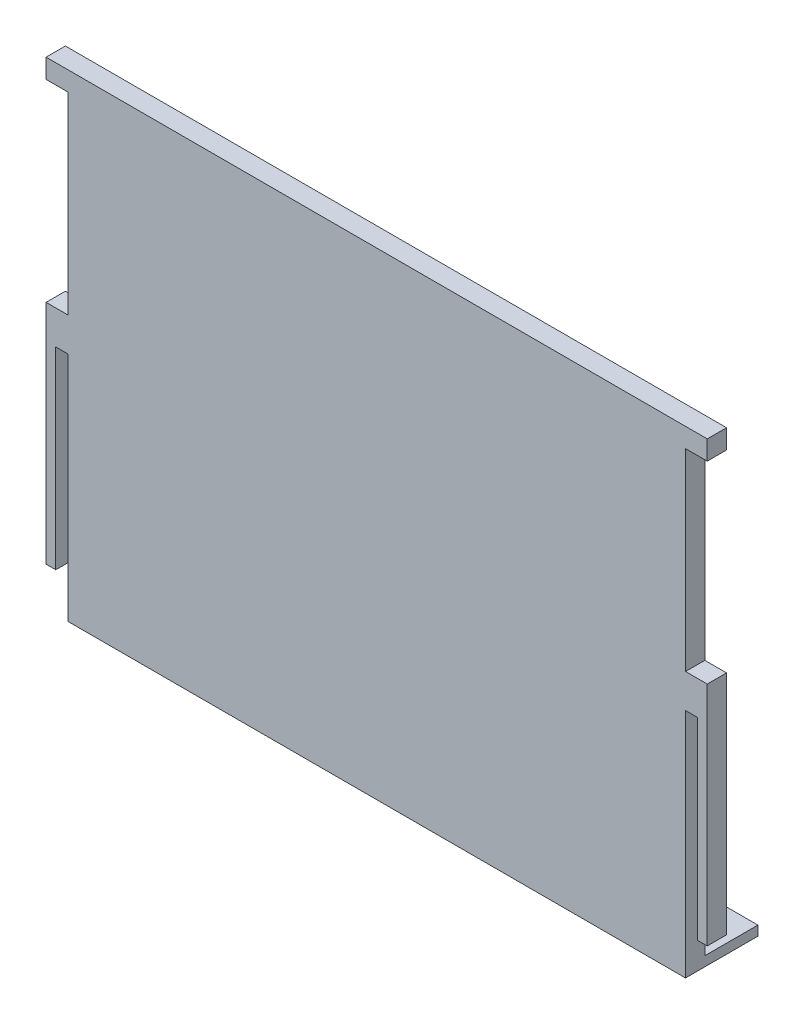
ISO-10303-21;
HEADER;
FILE_DESCRIPTION(('STEP AP214'),'2;1');
FILE_NAME('part.step','',(''),(''),'','','');
FILE_SCHEMA(('AUTOMOTIVE_DESIGN { 1 0 10303 214 1 1 1 1 }'));
ENDSEC;
DATA;
#1=APPLICATION_CONTEXT('core data for automotive mechanical design processes');
#2=APPLICATION_PROTOCOL_DEFINITION('international standard','automotive_design',2000,#1);
#3=PRODUCT_CONTEXT('',#1,'mechanical');
#4=PRODUCT('Part','Part','',(#3));
#5=PRODUCT_RELATED_PRODUCT_CATEGORY('part','',(#4));
#6=PRODUCT_DEFINITION_FORMATION('','',#4);
#7=PRODUCT_DEFINITION_CONTEXT('part definition',#1,'design');
#8=PRODUCT_DEFINITION('design','',#6,#7);
#9=PRODUCT_DEFINITION_SHAPE('','',#8);
#10=(LENGTH_UNIT() NAMED_UNIT(*) SI_UNIT(.MILLI.,.METRE.));
#11=(NAMED_UNIT(*) PLANE_ANGLE_UNIT() SI_UNIT($,.RADIAN.));
#12=(NAMED_UNIT(*) SI_UNIT($,.STERADIAN.) SOLID_ANGLE_UNIT());
#13=UNCERTAINTY_MEASURE_WITH_UNIT(LENGTH_MEASURE(1.E-05),#10,'distance_accuracy_value','');
#14=(GEOMETRIC_REPRESENTATION_CONTEXT(3) GLOBAL_UNCERTAINTY_ASSIGNED_CONTEXT((#13)) GLOBAL_UNIT_ASSIGNED_CONTEXT((#10,
#11,#12)) REPRESENTATION_CONTEXT('',''));
#15=CARTESIAN_POINT('',(0.,0.,0.));
#16=DIRECTION('',(0.,0.,1.));
#17=DIRECTION('',(1.,0.,0.));
#18=AXIS2_PLACEMENT_3D('',#15,#16,#17);
#19=CARTESIAN_POINT('',(68.5,-48.,4.));
#20=DIRECTION('',(-1.,0.,0.));
#21=DIRECTION('',(0.,0.,1.));
#22=AXIS2_PLACEMENT_3D('',#19,#20,#21);
#23=PLANE('',#22);
#24=DIRECTION('',(0.,0.,1.));
#25=VECTOR('',#24,1.);
#26=CARTESIAN_POINT('',(68.5,47.,0.));
#27=LINE('',#26,#25);
#28=CARTESIAN_POINT('',(68.5,47.,0.));
#29=VERTEX_POINT('',#28);
#30=CARTESIAN_POINT('',(68.5,47.,4.));
#31=VERTEX_POINT('',#30);
#32=EDGE_CURVE('E470',#29,#31,#27,.T.);
#33=ORIENTED_EDGE('',*,*,#32,.F.);
#34=DIRECTION('',(0.,1.,0.));
#35=VECTOR('',#34,1.);
#36=CARTESIAN_POINT('',(68.5,-48.,0.));
#37=LINE('',#36,#35);
#38=CARTESIAN_POINT('',(68.5,51.,0.));
#39=VERTEX_POINT('',#38);
#40=EDGE_CURVE('E596',#29,#39,#37,.T.);
#41=ORIENTED_EDGE('',*,*,#40,.T.);
#42=DIRECTION('',(0.,0.,-1.));
#43=VECTOR('',#42,1.);
#44=CARTESIAN_POINT('',(68.5,51.,4.));
#45=LINE('',#44,#43);
#46=CARTESIAN_POINT('',(68.5,51.,4.));
#47=VERTEX_POINT('',#46);
#48=EDGE_CURVE('E445',#47,#39,#45,.T.);
#49=ORIENTED_EDGE('',*,*,#48,.F.);
#50=DIRECTION('',(0.,1.,0.));
#51=VECTOR('',#50,1.);
#52=CARTESIAN_POINT('',(68.5,-48.,4.));
#53=LINE('',#52,#51);
#54=EDGE_CURVE('E607',#31,#47,#53,.T.);
#55=ORIENTED_EDGE('',*,*,#54,.F.);
#56=EDGE_LOOP('',(#33,#41,#49,#55));
#57=FACE_BOUND('',#56,.T.);
#58=ADVANCED_FACE('F39',(#57),#23,.F.);
#59=CARTESIAN_POINT('',(-68.5,-48.,4.));
#60=DIRECTION('',(1.,0.,0.));
#61=DIRECTION('',(0.,0.,-1.));
#62=AXIS2_PLACEMENT_3D('',#59,#60,#61);
#63=PLANE('',#62);
#64=DIRECTION('',(0.,0.,1.));
#65=VECTOR('',#64,1.);
#66=CARTESIAN_POINT('',(-68.5,47.,0.));
#67=LINE('',#66,#65);
#68=CARTESIAN_POINT('',(-68.5,47.,0.));
#69=VERTEX_POINT('',#68);
#70=CARTESIAN_POINT('',(-68.5,47.,4.));
#71=VERTEX_POINT('',#70);
#72=EDGE_CURVE('E544',#69,#71,#67,.T.);
#73=ORIENTED_EDGE('',*,*,#72,.T.);
#74=DIRECTION('',(0.,-1.,0.));
#75=VECTOR('',#74,1.);
#76=CARTESIAN_POINT('',(-68.5,-48.,4.));
#77=LINE('',#76,#75);
#78=CARTESIAN_POINT('',(-68.5,51.,4.00000000000002));
#79=VERTEX_POINT('',#78);
#80=EDGE_CURVE('E608',#79,#71,#77,.T.);
#81=ORIENTED_EDGE('',*,*,#80,.F.);
#82=DIRECTION('',(0.,0.,1.));
#83=VECTOR('',#82,1.);
#84=CARTESIAN_POINT('',(-68.5,51.,4.00000000000002));
#85=LINE('',#84,#83);
#86=CARTESIAN_POINT('',(-68.5,51.,0.));
#87=VERTEX_POINT('',#86);
#88=EDGE_CURVE('E456',#87,#79,#85,.T.);
#89=ORIENTED_EDGE('',*,*,#88,.F.);
#90=DIRECTION('',(0.,-1.,0.));
#91=VECTOR('',#90,1.);
#92=CARTESIAN_POINT('',(-68.5,-48.,0.));
#93=LINE('',#92,#91);
#94=EDGE_CURVE('E618',#87,#69,#93,.T.);
#95=ORIENTED_EDGE('',*,*,#94,.T.);
#96=EDGE_LOOP('',(#73,#81,#89,#95));
#97=FACE_BOUND('',#96,.T.);
#98=ADVANCED_FACE('F659',(#97),#63,.F.);
#99=CARTESIAN_POINT('',(0.,0.,4.));
#100=DIRECTION('',(0.,0.,-1.));
#101=DIRECTION('',(-1.,0.,0.));
#102=AXIS2_PLACEMENT_3D('',#99,#100,#101);
#103=PLANE('',#102);
#104=DIRECTION('',(0.,1.,0.));
#105=VECTOR('',#104,1.);
#106=CARTESIAN_POINT('',(-64.,0.,4.));
#107=LINE('',#106,#105);
#108=CARTESIAN_POINT('',(-64.,-48.,4.));
#109=VERTEX_POINT('',#108);
#110=CARTESIAN_POINT('',(-64.,0.,4.));
#111=VERTEX_POINT('',#110);
#112=EDGE_CURVE('E575',#109,#111,#107,.T.);
#113=ORIENTED_EDGE('',*,*,#112,.F.);
#114=DIRECTION('',(1.,0.,0.));
#115=VECTOR('',#114,1.);
#116=CARTESIAN_POINT('',(-68.5,-48.,4.));
#117=LINE('',#116,#115);
#118=CARTESIAN_POINT('',(64.,-48.,4.));
#119=VERTEX_POINT('',#118);
#120=EDGE_CURVE('E48',#109,#119,#117,.T.);
#121=ORIENTED_EDGE('',*,*,#120,.T.);
#122=DIRECTION('',(0.,-1.,0.));
#123=VECTOR('',#122,1.);
#124=CARTESIAN_POINT('',(64.,0.,4.));
#125=LINE('',#124,#123);
#126=CARTESIAN_POINT('',(64.,0.,4.));
#127=VERTEX_POINT('',#126);
#128=EDGE_CURVE('E514',#127,#119,#125,.T.);
#129=ORIENTED_EDGE('',*,*,#128,.F.);
#130=DIRECTION('',(1.,0.,0.));
#131=VECTOR('',#130,1.);
#132=CARTESIAN_POINT('',(0.,0.,4.));
#133=LINE('',#132,#131);
#134=CARTESIAN_POINT('',(66.5,0.,4.));
#135=VERTEX_POINT('',#134);
#136=EDGE_CURVE('E517',#127,#135,#133,.T.);
#137=ORIENTED_EDGE('',*,*,#136,.T.);
#138=DIRECTION('',(0.,-1.,0.));
#139=VECTOR('',#138,1.);
#140=CARTESIAN_POINT('',(66.5,0.,4.));
#141=LINE('',#140,#139);
#142=CARTESIAN_POINT('',(66.5,-40.,4.));
#143=VERTEX_POINT('',#142);
#144=EDGE_CURVE('E522',#135,#143,#141,.T.);
#145=ORIENTED_EDGE('',*,*,#144,.T.);
#146=DIRECTION('',(-1.,0.,0.));
#147=VECTOR('',#146,1.);
#148=CARTESIAN_POINT('',(64.,-40.,4.));
#149=LINE('',#148,#147);
#150=CARTESIAN_POINT('',(68.5,-40.,4.));
#151=VERTEX_POINT('',#150);
#152=EDGE_CURVE('E388',#151,#143,#149,.T.);
#153=ORIENTED_EDGE('',*,*,#152,.F.);
#154=CARTESIAN_POINT('',(68.5,6.99999999999999,4.));
#155=VERTEX_POINT('',#154);
#156=EDGE_CURVE('E603',#151,#155,#53,.T.);
#157=ORIENTED_EDGE('',*,*,#156,.T.);
#158=DIRECTION('',(1.,0.,0.));
#159=VECTOR('',#158,1.);
#160=CARTESIAN_POINT('',(64.,6.99999999999999,4.));
#161=LINE('',#160,#159);
#162=CARTESIAN_POINT('',(64.,6.99999999999999,4.));
#163=VERTEX_POINT('',#162);
#164=EDGE_CURVE('E487',#163,#155,#161,.T.);
#165=ORIENTED_EDGE('',*,*,#164,.F.);
#166=DIRECTION('',(0.,1.,0.));
#167=VECTOR('',#166,1.);
#168=CARTESIAN_POINT('',(64.,6.99999999999999,4.));
#169=LINE('',#168,#167);
#170=CARTESIAN_POINT('',(64.,47.,4.));
#171=VERTEX_POINT('',#170);
#172=EDGE_CURVE('E478',#163,#171,#169,.T.);
#173=ORIENTED_EDGE('',*,*,#172,.T.);
#174=DIRECTION('',(1.,0.,0.));
#175=VECTOR('',#174,1.);
#176=CARTESIAN_POINT('',(64.,47.,4.));
#177=LINE('',#176,#175);
#178=EDGE_CURVE('E482',#171,#31,#177,.T.);
#179=ORIENTED_EDGE('',*,*,#178,.T.);
#180=ORIENTED_EDGE('',*,*,#54,.T.);
#181=DIRECTION('',(1.,0.,0.));
#182=VECTOR('',#181,1.);
#183=CARTESIAN_POINT('',(68.5,51.,4.));
#184=LINE('',#183,#182);
#185=EDGE_CURVE('E460',#79,#47,#184,.T.);
#186=ORIENTED_EDGE('',*,*,#185,.F.);
#187=ORIENTED_EDGE('',*,*,#80,.T.);
#188=DIRECTION('',(1.,0.,0.));
#189=VECTOR('',#188,1.);
#190=CARTESIAN_POINT('',(-68.5,47.,4.));
#191=LINE('',#190,#189);
#192=CARTESIAN_POINT('',(-64.,47.,4.));
#193=VERTEX_POINT('',#192);
#194=EDGE_CURVE('E513',#71,#193,#191,.T.);
#195=ORIENTED_EDGE('',*,*,#194,.T.);
#196=DIRECTION('',(0.,-1.,0.));
#197=VECTOR('',#196,1.);
#198=CARTESIAN_POINT('',(-64.,47.,4.));
#199=LINE('',#198,#197);
#200=CARTESIAN_POINT('',(-64.,6.99999999999999,4.));
#201=VERTEX_POINT('',#200);
#202=EDGE_CURVE('E553',#193,#201,#199,.T.);
#203=ORIENTED_EDGE('',*,*,#202,.T.);
#204=DIRECTION('',(1.,0.,0.));
#205=VECTOR('',#204,1.);
#206=CARTESIAN_POINT('',(-68.5,6.99999999999999,4.));
#207=LINE('',#206,#205);
#208=CARTESIAN_POINT('',(-68.5,6.99999999999999,4.));
#209=VERTEX_POINT('',#208);
#210=EDGE_CURVE('E549',#209,#201,#207,.T.);
#211=ORIENTED_EDGE('',*,*,#210,.F.);
#212=CARTESIAN_POINT('',(-68.5,-40.,4.));
#213=VERTEX_POINT('',#212);
#214=EDGE_CURVE('E606',#209,#213,#77,.T.);
#215=ORIENTED_EDGE('',*,*,#214,.T.);
#216=DIRECTION('',(-1.,0.,0.));
#217=VECTOR('',#216,1.);
#218=CARTESIAN_POINT('',(-64.,-40.,4.));
#219=LINE('',#218,#217);
#220=CARTESIAN_POINT('',(-66.5,-40.,4.));
#221=VERTEX_POINT('',#220);
#222=EDGE_CURVE('E403',#221,#213,#219,.T.);
#223=ORIENTED_EDGE('',*,*,#222,.F.);
#224=DIRECTION('',(0.,-1.,0.));
#225=VECTOR('',#224,1.);
#226=CARTESIAN_POINT('',(-66.5,0.,4.));
#227=LINE('',#226,#225);
#228=CARTESIAN_POINT('',(-66.5,-3.74917113892465E-13,4.));
#229=VERTEX_POINT('',#228);
#230=EDGE_CURVE('E586',#229,#221,#227,.T.);
#231=ORIENTED_EDGE('',*,*,#230,.F.);
#232=DIRECTION('',(-1.,0.,0.));
#233=VECTOR('',#232,1.);
#234=CARTESIAN_POINT('',(0.,0.,4.));
#235=LINE('',#234,#233);
#236=EDGE_CURVE('E526',#111,#229,#235,.T.);
#237=ORIENTED_EDGE('',*,*,#236,.F.);
#238=EDGE_LOOP('',(#113,#121,#129,#137,#145,#153,#157,#165,#173,#179,#180,#186,#187,#195,#203,
#211,#215,#223,#231,#237));
#239=FACE_BOUND('',#238,.T.);
#240=ADVANCED_FACE('F647',(#239),#103,.F.);
#241=CARTESIAN_POINT('',(0.,0.,0.));
#242=DIRECTION('',(0.,0.,-1.));
#243=DIRECTION('',(-1.,0.,0.));
#244=AXIS2_PLACEMENT_3D('',#241,#242,#243);
#245=PLANE('',#244);
#246=DIRECTION('',(0.,1.,0.));
#247=VECTOR('',#246,1.);
#248=CARTESIAN_POINT('',(-34.6,-9.29999999999999,0.));
#249=LINE('',#248,#247);
#250=CARTESIAN_POINT('',(-34.6,-9.29999999999999,0.));
#251=VERTEX_POINT('',#250);
#252=CARTESIAN_POINT('',(-34.6,44.9,0.));
#253=VERTEX_POINT('',#252);
#254=EDGE_CURVE('E55',#251,#253,#249,.T.);
#255=ORIENTED_EDGE('',*,*,#254,.F.);
#256=DIRECTION('',(-1.,0.,0.));
#257=VECTOR('',#256,1.);
#258=CARTESIAN_POINT('',(-34.6,-9.29999999999999,0.));
#259=LINE('',#258,#257);
#260=CARTESIAN_POINT('',(34.6,-9.3,0.));
#261=VERTEX_POINT('',#260);
#262=EDGE_CURVE('E318',#261,#251,#259,.T.);
#263=ORIENTED_EDGE('',*,*,#262,.F.);
#264=DIRECTION('',(0.,-1.,0.));
#265=VECTOR('',#264,1.);
#266=CARTESIAN_POINT('',(34.6,-9.3,0.));
#267=LINE('',#266,#265);
#268=CARTESIAN_POINT('',(34.6,44.9,0.));
#269=VERTEX_POINT('',#268);
#270=EDGE_CURVE('E337',#269,#261,#267,.T.);
#271=ORIENTED_EDGE('',*,*,#270,.F.);
#272=DIRECTION('',(1.,0.,0.));
#273=VECTOR('',#272,1.);
#274=CARTESIAN_POINT('',(-34.6,44.9,0.));
#275=LINE('',#274,#273);
#276=EDGE_CURVE('E333',#253,#269,#275,.T.);
#277=ORIENTED_EDGE('',*,*,#276,.F.);
#278=EDGE_LOOP('',(#255,#263,#271,#277));
#279=FACE_BOUND('',#278,.T.);
#280=DIRECTION('',(0.,1.,0.));
#281=VECTOR('',#280,1.);
#282=CARTESIAN_POINT('',(20.8,-44.3,0.));
#283=LINE('',#282,#281);
#284=CARTESIAN_POINT('',(20.8,-44.3,0.));
#285=VERTEX_POINT('',#284);
#286=CARTESIAN_POINT('',(20.8,-16.1,0.));
#287=VERTEX_POINT('',#286);
#288=EDGE_CURVE('E63',#285,#287,#283,.T.);
#289=ORIENTED_EDGE('',*,*,#288,.F.);
#290=DIRECTION('',(-1.,0.,0.));
#291=VECTOR('',#290,1.);
#292=CARTESIAN_POINT('',(20.8,-44.3,0.));
#293=LINE('',#292,#291);
#294=CARTESIAN_POINT('',(60.,-44.3,0.));
#295=VERTEX_POINT('',#294);
#296=EDGE_CURVE('E284',#295,#285,#293,.T.);
#297=ORIENTED_EDGE('',*,*,#296,.F.);
#298=DIRECTION('',(0.,-1.,0.));
#299=VECTOR('',#298,1.);
#300=CARTESIAN_POINT('',(60.,-44.3,0.));
#301=LINE('',#300,#299);
#302=CARTESIAN_POINT('',(60.,-16.1,0.));
#303=VERTEX_POINT('',#302);
#304=EDGE_CURVE('E288',#303,#295,#301,.T.);
#305=ORIENTED_EDGE('',*,*,#304,.F.);
#306=DIRECTION('',(1.,0.,0.));
#307=VECTOR('',#306,1.);
#308=CARTESIAN_POINT('',(20.8,-16.1,0.));
#309=LINE('',#308,#307);
#310=EDGE_CURVE('E297',#287,#303,#309,.T.);
#311=ORIENTED_EDGE('',*,*,#310,.F.);
#312=EDGE_LOOP('',(#289,#297,#305,#311));
#313=FACE_BOUND('',#312,.T.);
#314=DIRECTION('',(0.,1.,0.));
#315=VECTOR('',#314,1.);
#316=CARTESIAN_POINT('',(-60.,-44.3,0.));
#317=LINE('',#316,#315);
#318=CARTESIAN_POINT('',(-60.,-44.3,0.));
#319=VERTEX_POINT('',#318);
#320=CARTESIAN_POINT('',(-60.,-16.1,0.));
#321=VERTEX_POINT('',#320);
#322=EDGE_CURVE('E307',#319,#321,#317,.T.);
#323=ORIENTED_EDGE('',*,*,#322,.F.);
#324=DIRECTION('',(-1.,0.,0.));
#325=VECTOR('',#324,1.);
#326=CARTESIAN_POINT('',(-60.,-44.3,0.));
#327=LINE('',#326,#325);
#328=CARTESIAN_POINT('',(-20.8,-44.3,0.));
#329=VERTEX_POINT('',#328);
#330=EDGE_CURVE('E359',#329,#319,#327,.T.);
#331=ORIENTED_EDGE('',*,*,#330,.F.);
#332=DIRECTION('',(0.,-1.,0.));
#333=VECTOR('',#332,1.);
#334=CARTESIAN_POINT('',(-20.8,-44.3,0.));
#335=LINE('',#334,#333);
#336=CARTESIAN_POINT('',(-20.8,-16.1,0.));
#337=VERTEX_POINT('',#336);
#338=EDGE_CURVE('E378',#337,#329,#335,.T.);
#339=ORIENTED_EDGE('',*,*,#338,.F.);
#340=DIRECTION('',(1.,0.,0.));
#341=VECTOR('',#340,1.);
#342=CARTESIAN_POINT('',(-60.,-16.1,0.));
#343=LINE('',#342,#341);
#344=EDGE_CURVE('E374',#321,#337,#343,.T.);
#345=ORIENTED_EDGE('',*,*,#344,.F.);
#346=EDGE_LOOP('',(#323,#331,#339,#345));
#347=FACE_BOUND('',#346,.T.);
#348=DIRECTION('',(1.,0.,0.));
#349=VECTOR('',#348,1.);
#350=CARTESIAN_POINT('',(68.5,-46.,0.));
#351=LINE('',#350,#349);
#352=CARTESIAN_POINT('',(-64.,-46.,0.));
#353=VERTEX_POINT('',#352);
#354=CARTESIAN_POINT('',(64.,-46.,0.));
#355=VERTEX_POINT('',#354);
#356=EDGE_CURVE('E436',#353,#355,#351,.T.);
#357=ORIENTED_EDGE('',*,*,#356,.F.);
#358=DIRECTION('',(0.,1.,0.));
#359=VECTOR('',#358,1.);
#360=CARTESIAN_POINT('',(-64.,0.,0.));
#361=LINE('',#360,#359);
#362=CARTESIAN_POINT('',(-64.,0.,0.));
#363=VERTEX_POINT('',#362);
#364=EDGE_CURVE('E579',#353,#363,#361,.T.);
#365=ORIENTED_EDGE('',*,*,#364,.T.);
#366=DIRECTION('',(-1.,0.,0.));
#367=VECTOR('',#366,1.);
#368=CARTESIAN_POINT('',(0.,0.,0.));
#369=LINE('',#368,#367);
#370=CARTESIAN_POINT('',(-66.5,-3.74917111245485E-13,0.));
#371=VERTEX_POINT('',#370);
#372=EDGE_CURVE('E570',#363,#371,#369,.T.);
#373=ORIENTED_EDGE('',*,*,#372,.T.);
#374=DIRECTION('',(0.,-1.,0.));
#375=VECTOR('',#374,1.);
#376=CARTESIAN_POINT('',(-66.5,0.,0.));
#377=LINE('',#376,#375);
#378=CARTESIAN_POINT('',(-66.5,-40.,0.));
#379=VERTEX_POINT('',#378);
#380=EDGE_CURVE('E574',#371,#379,#377,.T.);
#381=ORIENTED_EDGE('',*,*,#380,.T.);
#382=DIRECTION('',(1.,0.,0.));
#383=VECTOR('',#382,1.);
#384=CARTESIAN_POINT('',(0.,-40.,0.));
#385=LINE('',#384,#383);
#386=CARTESIAN_POINT('',(-68.5,-40.,0.));
#387=VERTEX_POINT('',#386);
#388=EDGE_CURVE('E433',#387,#379,#385,.T.);
#389=ORIENTED_EDGE('',*,*,#388,.F.);
#390=CARTESIAN_POINT('',(-68.5,6.99999999999999,0.));
#391=VERTEX_POINT('',#390);
#392=EDGE_CURVE('E617',#391,#387,#93,.T.);
#393=ORIENTED_EDGE('',*,*,#392,.F.);
#394=DIRECTION('',(1.,0.,0.));
#395=VECTOR('',#394,1.);
#396=CARTESIAN_POINT('',(-68.5,6.99999999999999,0.));
#397=LINE('',#396,#395);
#398=CARTESIAN_POINT('',(-64.,6.99999999999999,0.));
#399=VERTEX_POINT('',#398);
#400=EDGE_CURVE('E548',#391,#399,#397,.T.);
#401=ORIENTED_EDGE('',*,*,#400,.T.);
#402=DIRECTION('',(0.,-1.,0.));
#403=VECTOR('',#402,1.);
#404=CARTESIAN_POINT('',(-64.,47.,0.));
#405=LINE('',#404,#403);
#406=CARTESIAN_POINT('',(-64.,47.,0.));
#407=VERTEX_POINT('',#406);
#408=EDGE_CURVE('E564',#407,#399,#405,.T.);
#409=ORIENTED_EDGE('',*,*,#408,.F.);
#410=DIRECTION('',(1.,0.,0.));
#411=VECTOR('',#410,1.);
#412=CARTESIAN_POINT('',(-68.5,47.,0.));
#413=LINE('',#412,#411);
#414=EDGE_CURVE('E554',#69,#407,#413,.T.);
#415=ORIENTED_EDGE('',*,*,#414,.F.);
#416=ORIENTED_EDGE('',*,*,#94,.F.);
#417=DIRECTION('',(-1.,0.,0.));
#418=VECTOR('',#417,1.);
#419=CARTESIAN_POINT('',(68.5,51.,0.));
#420=LINE('',#419,#418);
#421=EDGE_CURVE('E452',#39,#87,#420,.T.);
#422=ORIENTED_EDGE('',*,*,#421,.F.);
#423=ORIENTED_EDGE('',*,*,#40,.F.);
#424=DIRECTION('',(1.,0.,0.));
#425=VECTOR('',#424,1.);
#426=CARTESIAN_POINT('',(64.,47.,0.));
#427=LINE('',#426,#425);
#428=CARTESIAN_POINT('',(64.,47.,0.));
#429=VERTEX_POINT('',#428);
#430=EDGE_CURVE('E495',#429,#29,#427,.T.);
#431=ORIENTED_EDGE('',*,*,#430,.F.);
#432=DIRECTION('',(0.,1.,0.));
#433=VECTOR('',#432,1.);
#434=CARTESIAN_POINT('',(64.,6.99999999999999,0.));
#435=LINE('',#434,#433);
#436=CARTESIAN_POINT('',(64.,6.99999999999999,0.));
#437=VERTEX_POINT('',#436);
#438=EDGE_CURVE('E469',#437,#429,#435,.T.);
#439=ORIENTED_EDGE('',*,*,#438,.F.);
#440=DIRECTION('',(1.,0.,0.));
#441=VECTOR('',#440,1.);
#442=CARTESIAN_POINT('',(64.,6.99999999999999,0.));
#443=LINE('',#442,#441);
#444=CARTESIAN_POINT('',(68.5,6.99999999999999,0.));
#445=VERTEX_POINT('',#444);
#446=EDGE_CURVE('E483',#437,#445,#443,.T.);
#447=ORIENTED_EDGE('',*,*,#446,.T.);
#448=CARTESIAN_POINT('',(68.5,-40.,0.));
#449=VERTEX_POINT('',#448);
#450=EDGE_CURVE('E615',#449,#445,#37,.T.);
#451=ORIENTED_EDGE('',*,*,#450,.F.);
#452=DIRECTION('',(1.,0.,0.));
#453=VECTOR('',#452,1.);
#454=CARTESIAN_POINT('',(0.,-40.,0.));
#455=LINE('',#454,#453);
#456=CARTESIAN_POINT('',(66.5,-40.,0.));
#457=VERTEX_POINT('',#456);
#458=EDGE_CURVE('E430',#457,#449,#455,.T.);
#459=ORIENTED_EDGE('',*,*,#458,.F.);
#460=DIRECTION('',(0.,-1.,0.));
#461=VECTOR('',#460,1.);
#462=CARTESIAN_POINT('',(66.5,0.,0.));
#463=LINE('',#462,#461);
#464=CARTESIAN_POINT('',(66.5,0.,0.));
#465=VERTEX_POINT('',#464);
#466=EDGE_CURVE('E518',#465,#457,#463,.T.);
#467=ORIENTED_EDGE('',*,*,#466,.F.);
#468=DIRECTION('',(1.,0.,0.));
#469=VECTOR('',#468,1.);
#470=CARTESIAN_POINT('',(0.,0.,0.));
#471=LINE('',#470,#469);
#472=CARTESIAN_POINT('',(64.,0.,0.));
#473=VERTEX_POINT('',#472);
#474=EDGE_CURVE('E529',#473,#465,#471,.T.);
#475=ORIENTED_EDGE('',*,*,#474,.F.);
#476=DIRECTION('',(0.,-1.,0.));
#477=VECTOR('',#476,1.);
#478=CARTESIAN_POINT('',(64.,0.,0.));
#479=LINE('',#478,#477);
#480=EDGE_CURVE('E505',#473,#355,#479,.T.);
#481=ORIENTED_EDGE('',*,*,#480,.T.);
#482=EDGE_LOOP('',(#357,#365,#373,#381,#389,#393,#401,#409,#415,#416,#422,#423,#431,#439,#447,
#451,#459,#467,#475,#481));
#483=FACE_BOUND('',#482,.T.);
#484=ADVANCED_FACE('F635',(#279,#313,#347,#483),#245,.T.);
#485=ORIENTED_EDGE('',*,*,#156,.F.);
#486=DIRECTION('',(0.,0.,1.));
#487=VECTOR('',#486,1.);
#488=CARTESIAN_POINT('',(68.5,-40.,-11.));
#489=LINE('',#488,#487);
#490=EDGE_CURVE('E406',#449,#151,#489,.T.);
#491=ORIENTED_EDGE('',*,*,#490,.F.);
#492=ORIENTED_EDGE('',*,*,#450,.T.);
#493=DIRECTION('',(0.,0.,1.));
#494=VECTOR('',#493,1.);
#495=CARTESIAN_POINT('',(68.5,6.99999999999999,0.));
#496=LINE('',#495,#494);
#497=EDGE_CURVE('E465',#445,#155,#496,.T.);
#498=ORIENTED_EDGE('',*,*,#497,.T.);
#499=EDGE_LOOP('',(#485,#491,#492,#498));
#500=FACE_BOUND('',#499,.T.);
#501=ADVANCED_FACE('F41',(#500),#23,.F.);
#502=ORIENTED_EDGE('',*,*,#392,.T.);
#503=DIRECTION('',(0.,0.,1.));
#504=VECTOR('',#503,1.);
#505=CARTESIAN_POINT('',(-68.5,-40.,-11.));
#506=LINE('',#505,#504);
#507=EDGE_CURVE('E402',#387,#213,#506,.T.);
#508=ORIENTED_EDGE('',*,*,#507,.T.);
#509=ORIENTED_EDGE('',*,*,#214,.F.);
#510=DIRECTION('',(0.,0.,1.));
#511=VECTOR('',#510,1.);
#512=CARTESIAN_POINT('',(-68.5,6.99999999999999,0.));
#513=LINE('',#512,#511);
#514=EDGE_CURVE('E541',#391,#209,#513,.T.);
#515=ORIENTED_EDGE('',*,*,#514,.F.);
#516=EDGE_LOOP('',(#502,#508,#509,#515));
#517=FACE_BOUND('',#516,.T.);
#518=ADVANCED_FACE('F629',(#517),#63,.F.);
#519=CARTESIAN_POINT('',(-68.5,-48.,4.));
#520=DIRECTION('',(0.,1.,0.));
#521=DIRECTION('',(0.,0.,1.));
#522=AXIS2_PLACEMENT_3D('',#519,#520,#521);
#523=PLANE('',#522);
#524=ORIENTED_EDGE('',*,*,#120,.F.);
#525=DIRECTION('',(0.,0.,1.));
#526=VECTOR('',#525,1.);
#527=CARTESIAN_POINT('',(-64.,-48.,-11.));
#528=LINE('',#527,#526);
#529=CARTESIAN_POINT('',(-64.,-48.,-11.));
#530=VERTEX_POINT('',#529);
#531=EDGE_CURVE('E407',#530,#109,#528,.T.);
#532=ORIENTED_EDGE('',*,*,#531,.F.);
#533=DIRECTION('',(-1.,0.,0.));
#534=VECTOR('',#533,1.);
#535=CARTESIAN_POINT('',(68.5,-48.,-11.));
#536=LINE('',#535,#534);
#537=CARTESIAN_POINT('',(64.,-48.,-11.));
#538=VERTEX_POINT('',#537);
#539=EDGE_CURVE('E437',#538,#530,#536,.T.);
#540=ORIENTED_EDGE('',*,*,#539,.F.);
#541=DIRECTION('',(0.,0.,1.));
#542=VECTOR('',#541,1.);
#543=CARTESIAN_POINT('',(64.,-48.,-11.));
#544=LINE('',#543,#542);
#545=EDGE_CURVE('E417',#538,#119,#544,.T.);
#546=ORIENTED_EDGE('',*,*,#545,.T.);
#547=EDGE_LOOP('',(#524,#532,#540,#546));
#548=FACE_BOUND('',#547,.T.);
#549=ADVANCED_FACE('F714',(#548),#523,.F.);
#550=CARTESIAN_POINT('',(0.,0.,0.));
#551=DIRECTION('',(0.,1.,0.));
#552=DIRECTION('',(-1.,0.,0.));
#553=AXIS2_PLACEMENT_3D('',#550,#551,#552);
#554=PLANE('',#553);
#555=ORIENTED_EDGE('',*,*,#236,.T.);
#556=DIRECTION('',(0.,0.,1.));
#557=VECTOR('',#556,1.);
#558=CARTESIAN_POINT('',(-66.5,-3.74917111245485E-13,0.));
#559=LINE('',#558,#557);
#560=EDGE_CURVE('E583',#371,#229,#559,.T.);
#561=ORIENTED_EDGE('',*,*,#560,.F.);
#562=ORIENTED_EDGE('',*,*,#372,.F.);
#563=DIRECTION('',(0.,0.,1.));
#564=VECTOR('',#563,1.);
#565=CARTESIAN_POINT('',(-64.,0.,0.));
#566=LINE('',#565,#564);
#567=EDGE_CURVE('E593',#363,#111,#566,.T.);
#568=ORIENTED_EDGE('',*,*,#567,.T.);
#569=EDGE_LOOP('',(#555,#561,#562,#568));
#570=FACE_BOUND('',#569,.T.);
#571=ADVANCED_FACE('F717',(#570),#554,.F.);
#572=CARTESIAN_POINT('',(-64.,0.,0.));
#573=DIRECTION('',(1.,0.,0.));
#574=DIRECTION('',(0.,1.,0.));
#575=AXIS2_PLACEMENT_3D('',#572,#573,#574);
#576=PLANE('',#575);
#577=ORIENTED_EDGE('',*,*,#112,.T.);
#578=ORIENTED_EDGE('',*,*,#567,.F.);
#579=ORIENTED_EDGE('',*,*,#364,.F.);
#580=DIRECTION('',(0.,0.,1.));
#581=VECTOR('',#580,1.);
#582=CARTESIAN_POINT('',(-64.,-46.,-11.));
#583=LINE('',#582,#581);
#584=CARTESIAN_POINT('',(-64.,-46.,-11.));
#585=VERTEX_POINT('',#584);
#586=EDGE_CURVE('E426',#585,#353,#583,.T.);
#587=ORIENTED_EDGE('',*,*,#586,.F.);
#588=DIRECTION('',(0.,1.,0.));
#589=VECTOR('',#588,1.);
#590=CARTESIAN_POINT('',(-64.,-40.,-11.));
#591=LINE('',#590,#589);
#592=EDGE_CURVE('E398',#530,#585,#591,.T.);
#593=ORIENTED_EDGE('',*,*,#592,.F.);
#594=ORIENTED_EDGE('',*,*,#531,.T.);
#595=EDGE_LOOP('',(#577,#578,#579,#587,#593,#594));
#596=FACE_BOUND('',#595,.T.);
#597=ADVANCED_FACE('F707',(#596),#576,.F.);
#598=CARTESIAN_POINT('',(-66.5,0.,0.));
#599=DIRECTION('',(-1.,0.,0.));
#600=DIRECTION('',(0.,-1.,0.));
#601=AXIS2_PLACEMENT_3D('',#598,#599,#600);
#602=PLANE('',#601);
#603=ORIENTED_EDGE('',*,*,#230,.T.);
#604=DIRECTION('',(0.,0.,1.));
#605=VECTOR('',#604,1.);
#606=CARTESIAN_POINT('',(-66.5,-40.,0.));
#607=LINE('',#606,#605);
#608=EDGE_CURVE('E597',#379,#221,#607,.T.);
#609=ORIENTED_EDGE('',*,*,#608,.F.);
#610=ORIENTED_EDGE('',*,*,#380,.F.);
#611=ORIENTED_EDGE('',*,*,#560,.T.);
#612=EDGE_LOOP('',(#603,#609,#610,#611));
#613=FACE_BOUND('',#612,.T.);
#614=ADVANCED_FACE('F643',(#613),#602,.F.);
#615=CARTESIAN_POINT('',(64.,6.99999999999999,0.));
#616=DIRECTION('',(0.,-1.,0.));
#617=DIRECTION('',(0.,0.,-1.));
#618=AXIS2_PLACEMENT_3D('',#615,#616,#617);
#619=PLANE('',#618);
#620=ORIENTED_EDGE('',*,*,#164,.T.);
#621=ORIENTED_EDGE('',*,*,#497,.F.);
#622=ORIENTED_EDGE('',*,*,#446,.F.);
#623=DIRECTION('',(0.,0.,1.));
#624=VECTOR('',#623,1.);
#625=CARTESIAN_POINT('',(64.,6.99999999999999,0.));
#626=LINE('',#625,#624);
#627=EDGE_CURVE('E464',#437,#163,#626,.T.);
#628=ORIENTED_EDGE('',*,*,#627,.T.);
#629=EDGE_LOOP('',(#620,#621,#622,#628));
#630=FACE_BOUND('',#629,.T.);
#631=ADVANCED_FACE('F681',(#630),#619,.F.);
#632=CARTESIAN_POINT('',(64.,6.99999999999999,0.));
#633=DIRECTION('',(1.,0.,0.));
#634=DIRECTION('',(0.,1.,0.));
#635=AXIS2_PLACEMENT_3D('',#632,#633,#634);
#636=PLANE('',#635);
#637=ORIENTED_EDGE('',*,*,#172,.F.);
#638=ORIENTED_EDGE('',*,*,#627,.F.);
#639=ORIENTED_EDGE('',*,*,#438,.T.);
#640=DIRECTION('',(0.,0.,1.));
#641=VECTOR('',#640,1.);
#642=CARTESIAN_POINT('',(64.,47.,0.));
#643=LINE('',#642,#641);
#644=EDGE_CURVE('E473',#429,#171,#643,.T.);
#645=ORIENTED_EDGE('',*,*,#644,.T.);
#646=EDGE_LOOP('',(#637,#638,#639,#645));
#647=FACE_BOUND('',#646,.T.);
#648=ADVANCED_FACE('F676',(#647),#636,.T.);
#649=CARTESIAN_POINT('',(64.,47.,0.));
#650=DIRECTION('',(0.,-1.,0.));
#651=DIRECTION('',(0.,0.,-1.));
#652=AXIS2_PLACEMENT_3D('',#649,#650,#651);
#653=PLANE('',#652);
#654=ORIENTED_EDGE('',*,*,#178,.F.);
#655=ORIENTED_EDGE('',*,*,#644,.F.);
#656=ORIENTED_EDGE('',*,*,#430,.T.);
#657=ORIENTED_EDGE('',*,*,#32,.T.);
#658=EDGE_LOOP('',(#654,#655,#656,#657));
#659=FACE_BOUND('',#658,.T.);
#660=ADVANCED_FACE('F673',(#659),#653,.T.);
#661=CARTESIAN_POINT('',(-68.5,47.,0.));
#662=DIRECTION('',(0.,-1.,0.));
#663=DIRECTION('',(0.,0.,-1.));
#664=AXIS2_PLACEMENT_3D('',#661,#662,#663);
#665=PLANE('',#664);
#666=ORIENTED_EDGE('',*,*,#194,.F.);
#667=ORIENTED_EDGE('',*,*,#72,.F.);
#668=ORIENTED_EDGE('',*,*,#414,.T.);
#669=DIRECTION('',(0.,0.,1.));
#670=VECTOR('',#669,1.);
#671=CARTESIAN_POINT('',(-64.,47.,0.));
#672=LINE('',#671,#670);
#673=EDGE_CURVE('E491',#407,#193,#672,.T.);
#674=ORIENTED_EDGE('',*,*,#673,.T.);
#675=EDGE_LOOP('',(#666,#667,#668,#674));
#676=FACE_BOUND('',#675,.T.);
#677=ADVANCED_FACE('F658',(#676),#665,.T.);
#678=CARTESIAN_POINT('',(-64.,47.,0.));
#679=DIRECTION('',(-1.,0.,0.));
#680=DIRECTION('',(0.,0.,1.));
#681=AXIS2_PLACEMENT_3D('',#678,#679,#680);
#682=PLANE('',#681);
#683=ORIENTED_EDGE('',*,*,#202,.F.);
#684=ORIENTED_EDGE('',*,*,#673,.F.);
#685=ORIENTED_EDGE('',*,*,#408,.T.);
#686=DIRECTION('',(0.,0.,1.));
#687=VECTOR('',#686,1.);
#688=CARTESIAN_POINT('',(-64.,6.99999999999999,0.));
#689=LINE('',#688,#687);
#690=EDGE_CURVE('E538',#399,#201,#689,.T.);
#691=ORIENTED_EDGE('',*,*,#690,.T.);
#692=EDGE_LOOP('',(#683,#684,#685,#691));
#693=FACE_BOUND('',#692,.T.);
#694=ADVANCED_FACE('F654',(#693),#682,.T.);
#695=CARTESIAN_POINT('',(-68.5,6.99999999999999,0.));
#696=DIRECTION('',(0.,-1.,0.));
#697=DIRECTION('',(0.,0.,-1.));
#698=AXIS2_PLACEMENT_3D('',#695,#696,#697);
#699=PLANE('',#698);
#700=ORIENTED_EDGE('',*,*,#210,.T.);
#701=ORIENTED_EDGE('',*,*,#690,.F.);
#702=ORIENTED_EDGE('',*,*,#400,.F.);
#703=ORIENTED_EDGE('',*,*,#514,.T.);
#704=EDGE_LOOP('',(#700,#701,#702,#703));
#705=FACE_BOUND('',#704,.T.);
#706=ADVANCED_FACE('F651',(#705),#699,.F.);
#707=CARTESIAN_POINT('',(66.5,0.,0.));
#708=DIRECTION('',(-1.,0.,0.));
#709=DIRECTION('',(0.,0.,1.));
#710=AXIS2_PLACEMENT_3D('',#707,#708,#709);
#711=PLANE('',#710);
#712=ORIENTED_EDGE('',*,*,#144,.F.);
#713=DIRECTION('',(0.,0.,1.));
#714=VECTOR('',#713,1.);
#715=CARTESIAN_POINT('',(66.5,0.,0.));
#716=LINE('',#715,#714);
#717=EDGE_CURVE('E501',#465,#135,#716,.T.);
#718=ORIENTED_EDGE('',*,*,#717,.F.);
#719=ORIENTED_EDGE('',*,*,#466,.T.);
#720=DIRECTION('',(0.,0.,1.));
#721=VECTOR('',#720,1.);
#722=CARTESIAN_POINT('',(66.5,-40.,0.));
#723=LINE('',#722,#721);
#724=EDGE_CURVE('E509',#457,#143,#723,.T.);
#725=ORIENTED_EDGE('',*,*,#724,.T.);
#726=EDGE_LOOP('',(#712,#718,#719,#725));
#727=FACE_BOUND('',#726,.T.);
#728=ADVANCED_FACE('F695',(#727),#711,.T.);
#729=CARTESIAN_POINT('',(64.,0.,0.));
#730=DIRECTION('',(-1.,0.,0.));
#731=DIRECTION('',(0.,0.,1.));
#732=AXIS2_PLACEMENT_3D('',#729,#730,#731);
#733=PLANE('',#732);
#734=ORIENTED_EDGE('',*,*,#128,.T.);
#735=ORIENTED_EDGE('',*,*,#545,.F.);
#736=DIRECTION('',(0.,-1.,0.));
#737=VECTOR('',#736,1.);
#738=CARTESIAN_POINT('',(64.,0.,-11.));
#739=LINE('',#738,#737);
#740=CARTESIAN_POINT('',(64.,-46.,-11.));
#741=VERTEX_POINT('',#740);
#742=EDGE_CURVE('E11',#741,#538,#739,.T.);
#743=ORIENTED_EDGE('',*,*,#742,.F.);
#744=DIRECTION('',(0.,0.,-1.));
#745=VECTOR('',#744,1.);
#746=CARTESIAN_POINT('',(64.,-46.,-11.));
#747=LINE('',#746,#745);
#748=EDGE_CURVE('E411',#355,#741,#747,.T.);
#749=ORIENTED_EDGE('',*,*,#748,.F.);
#750=ORIENTED_EDGE('',*,*,#480,.F.);
#751=DIRECTION('',(0.,0.,1.));
#752=VECTOR('',#751,1.);
#753=CARTESIAN_POINT('',(64.,0.,0.));
#754=LINE('',#753,#752);
#755=EDGE_CURVE('E506',#473,#127,#754,.T.);
#756=ORIENTED_EDGE('',*,*,#755,.T.);
#757=EDGE_LOOP('',(#734,#735,#743,#749,#750,#756));
#758=FACE_BOUND('',#757,.T.);
#759=ADVANCED_FACE('F702',(#758),#733,.F.);
#760=CARTESIAN_POINT('',(0.,0.,0.));
#761=DIRECTION('',(0.,-1.,0.));
#762=DIRECTION('',(0.,0.,-1.));
#763=AXIS2_PLACEMENT_3D('',#760,#761,#762);
#764=PLANE('',#763);
#765=ORIENTED_EDGE('',*,*,#136,.F.);
#766=ORIENTED_EDGE('',*,*,#755,.F.);
#767=ORIENTED_EDGE('',*,*,#474,.T.);
#768=ORIENTED_EDGE('',*,*,#717,.T.);
#769=EDGE_LOOP('',(#765,#766,#767,#768));
#770=FACE_BOUND('',#769,.T.);
#771=ADVANCED_FACE('F697',(#770),#764,.T.);
#772=CARTESIAN_POINT('',(0.,51.,0.));
#773=DIRECTION('',(0.,1.,0.));
#774=DIRECTION('',(0.,0.,1.));
#775=AXIS2_PLACEMENT_3D('',#772,#773,#774);
#776=PLANE('',#775);
#777=ORIENTED_EDGE('',*,*,#48,.T.);
#778=ORIENTED_EDGE('',*,*,#421,.T.);
#779=ORIENTED_EDGE('',*,*,#88,.T.);
#780=ORIENTED_EDGE('',*,*,#185,.T.);
#781=EDGE_LOOP('',(#777,#778,#779,#780));
#782=FACE_BOUND('',#781,.T.);
#783=ADVANCED_FACE('F664',(#782),#776,.T.);
#784=CARTESIAN_POINT('',(68.5,-46.,-11.));
#785=DIRECTION('',(0.,-1.,0.));
#786=DIRECTION('',(0.,0.,-1.));
#787=AXIS2_PLACEMENT_3D('',#784,#785,#786);
#788=PLANE('',#787);
#789=DIRECTION('',(1.,0.,0.));
#790=VECTOR('',#789,1.);
#791=CARTESIAN_POINT('',(68.5,-46.,-11.));
#792=LINE('',#791,#790);
#793=EDGE_CURVE('E441',#585,#741,#792,.T.);
#794=ORIENTED_EDGE('',*,*,#793,.F.);
#795=ORIENTED_EDGE('',*,*,#586,.T.);
#796=ORIENTED_EDGE('',*,*,#356,.T.);
#797=ORIENTED_EDGE('',*,*,#748,.T.);
#798=EDGE_LOOP('',(#794,#795,#796,#797));
#799=FACE_BOUND('',#798,.T.);
#800=ADVANCED_FACE('F705',(#799),#788,.F.);
#801=CARTESIAN_POINT('',(0.,0.,-11.));
#802=DIRECTION('',(0.,0.,1.));
#803=DIRECTION('',(1.,0.,0.));
#804=AXIS2_PLACEMENT_3D('',#801,#802,#803);
#805=PLANE('',#804);
#806=ORIENTED_EDGE('',*,*,#539,.T.);
#807=ORIENTED_EDGE('',*,*,#592,.T.);
#808=ORIENTED_EDGE('',*,*,#793,.T.);
#809=ORIENTED_EDGE('',*,*,#742,.T.);
#810=EDGE_LOOP('',(#806,#807,#808,#809));
#811=FACE_BOUND('',#810,.T.);
#812=ADVANCED_FACE('F710',(#811),#805,.F.);
#813=CARTESIAN_POINT('',(64.,-40.,-11.));
#814=DIRECTION('',(0.,1.,0.));
#815=DIRECTION('',(0.,0.,1.));
#816=AXIS2_PLACEMENT_3D('',#813,#814,#815);
#817=PLANE('',#816);
#818=ORIENTED_EDGE('',*,*,#458,.T.);
#819=ORIENTED_EDGE('',*,*,#490,.T.);
#820=ORIENTED_EDGE('',*,*,#152,.T.);
#821=ORIENTED_EDGE('',*,*,#724,.F.);
#822=EDGE_LOOP('',(#818,#819,#820,#821));
#823=FACE_BOUND('',#822,.T.);
#824=ADVANCED_FACE('F690',(#823),#817,.F.);
#825=CARTESIAN_POINT('',(-64.,-40.,-11.));
#826=DIRECTION('',(0.,1.,0.));
#827=DIRECTION('',(0.,0.,1.));
#828=AXIS2_PLACEMENT_3D('',#825,#826,#827);
#829=PLANE('',#828);
#830=ORIENTED_EDGE('',*,*,#388,.T.);
#831=ORIENTED_EDGE('',*,*,#608,.T.);
#832=ORIENTED_EDGE('',*,*,#222,.T.);
#833=ORIENTED_EDGE('',*,*,#507,.F.);
#834=EDGE_LOOP('',(#830,#831,#832,#833));
#835=FACE_BOUND('',#834,.T.);
#836=ADVANCED_FACE('F640',(#835),#829,.F.);
#837=CARTESIAN_POINT('',(-60.,-44.3,2.));
#838=DIRECTION('',(-1.,0.,0.));
#839=DIRECTION('',(0.,0.,1.));
#840=AXIS2_PLACEMENT_3D('',#837,#838,#839);
#841=PLANE('',#840);
#842=ORIENTED_EDGE('',*,*,#322,.T.);
#843=DIRECTION('',(0.,0.,-1.));
#844=VECTOR('',#843,1.);
#845=CARTESIAN_POINT('',(-60.,-16.1,2.));
#846=LINE('',#845,#844);
#847=CARTESIAN_POINT('',(-60.,-16.1,2.));
#848=VERTEX_POINT('',#847);
#849=EDGE_CURVE('E371',#848,#321,#846,.T.);
#850=ORIENTED_EDGE('',*,*,#849,.F.);
#851=DIRECTION('',(0.,1.,0.));
#852=VECTOR('',#851,1.);
#853=CARTESIAN_POINT('',(-60.,-44.3,2.));
#854=LINE('',#853,#852);
#855=CARTESIAN_POINT('',(-60.,-44.3,2.));
#856=VERTEX_POINT('',#855);
#857=EDGE_CURVE('E354',#856,#848,#854,.T.);
#858=ORIENTED_EDGE('',*,*,#857,.F.);
#859=DIRECTION('',(0.,0.,-1.));
#860=VECTOR('',#859,1.);
#861=CARTESIAN_POINT('',(-60.,-44.3,2.));
#862=LINE('',#861,#860);
#863=EDGE_CURVE('E385',#856,#319,#862,.T.);
#864=ORIENTED_EDGE('',*,*,#863,.T.);
#865=EDGE_LOOP('',(#842,#850,#858,#864));
#866=FACE_BOUND('',#865,.T.);
#867=ADVANCED_FACE('F752',(#866),#841,.F.);
#868=CARTESIAN_POINT('',(-60.,-44.3,2.));
#869=DIRECTION('',(0.,-1.,0.));
#870=DIRECTION('',(1.,0.,0.));
#871=AXIS2_PLACEMENT_3D('',#868,#869,#870);
#872=PLANE('',#871);
#873=ORIENTED_EDGE('',*,*,#330,.T.);
#874=ORIENTED_EDGE('',*,*,#863,.F.);
#875=DIRECTION('',(-1.,0.,0.));
#876=VECTOR('',#875,1.);
#877=CARTESIAN_POINT('',(-60.,-44.3,2.));
#878=LINE('',#877,#876);
#879=CARTESIAN_POINT('',(-20.8,-44.3,2.));
#880=VERTEX_POINT('',#879);
#881=EDGE_CURVE('E367',#880,#856,#878,.T.);
#882=ORIENTED_EDGE('',*,*,#881,.F.);
#883=DIRECTION('',(0.,0.,-1.));
#884=VECTOR('',#883,1.);
#885=CARTESIAN_POINT('',(-20.8,-44.3,2.));
#886=LINE('',#885,#884);
#887=EDGE_CURVE('E389',#880,#329,#886,.T.);
#888=ORIENTED_EDGE('',*,*,#887,.T.);
#889=EDGE_LOOP('',(#873,#874,#882,#888));
#890=FACE_BOUND('',#889,.T.);
#891=ADVANCED_FACE('F762',(#890),#872,.F.);
#892=CARTESIAN_POINT('',(-20.8,-44.3,2.));
#893=DIRECTION('',(1.,0.,0.));
#894=DIRECTION('',(0.,1.,0.));
#895=AXIS2_PLACEMENT_3D('',#892,#893,#894);
#896=PLANE('',#895);
#897=ORIENTED_EDGE('',*,*,#338,.T.);
#898=ORIENTED_EDGE('',*,*,#887,.F.);
#899=DIRECTION('',(0.,-1.,0.));
#900=VECTOR('',#899,1.);
#901=CARTESIAN_POINT('',(-20.8,-44.3,2.));
#902=LINE('',#901,#900);
#903=CARTESIAN_POINT('',(-20.8,-16.1,2.));
#904=VERTEX_POINT('',#903);
#905=EDGE_CURVE('E363',#904,#880,#902,.T.);
#906=ORIENTED_EDGE('',*,*,#905,.F.);
#907=DIRECTION('',(0.,0.,-1.));
#908=VECTOR('',#907,1.);
#909=CARTESIAN_POINT('',(-20.8,-16.1,2.));
#910=LINE('',#909,#908);
#911=EDGE_CURVE('E392',#904,#337,#910,.T.);
#912=ORIENTED_EDGE('',*,*,#911,.T.);
#913=EDGE_LOOP('',(#897,#898,#906,#912));
#914=FACE_BOUND('',#913,.T.);
#915=ADVANCED_FACE('F764',(#914),#896,.F.);
#916=CARTESIAN_POINT('',(-60.,-16.1,2.));
#917=DIRECTION('',(0.,1.,0.));
#918=DIRECTION('',(-1.,0.,0.));
#919=AXIS2_PLACEMENT_3D('',#916,#917,#918);
#920=PLANE('',#919);
#921=ORIENTED_EDGE('',*,*,#344,.T.);
#922=ORIENTED_EDGE('',*,*,#911,.F.);
#923=DIRECTION('',(1.,0.,0.));
#924=VECTOR('',#923,1.);
#925=CARTESIAN_POINT('',(-60.,-16.1,2.));
#926=LINE('',#925,#924);
#927=EDGE_CURVE('E358',#848,#904,#926,.T.);
#928=ORIENTED_EDGE('',*,*,#927,.F.);
#929=ORIENTED_EDGE('',*,*,#849,.T.);
#930=EDGE_LOOP('',(#921,#922,#928,#929));
#931=FACE_BOUND('',#930,.T.);
#932=ADVANCED_FACE('F756',(#931),#920,.F.);
#933=CARTESIAN_POINT('',(0.,0.,2.));
#934=DIRECTION('',(0.,0.,-1.));
#935=DIRECTION('',(-1.,0.,0.));
#936=AXIS2_PLACEMENT_3D('',#933,#934,#935);
#937=PLANE('',#936);
#938=ORIENTED_EDGE('',*,*,#857,.T.);
#939=ORIENTED_EDGE('',*,*,#927,.T.);
#940=ORIENTED_EDGE('',*,*,#905,.T.);
#941=ORIENTED_EDGE('',*,*,#881,.T.);
#942=EDGE_LOOP('',(#938,#939,#940,#941));
#943=FACE_BOUND('',#942,.T.);
#944=ADVANCED_FACE('F759',(#943),#937,.T.);
#945=CARTESIAN_POINT('',(20.8,-44.3,2.));
#946=DIRECTION('',(-1.,0.,0.));
#947=DIRECTION('',(0.,0.,1.));
#948=AXIS2_PLACEMENT_3D('',#945,#946,#947);
#949=PLANE('',#948);
#950=ORIENTED_EDGE('',*,*,#288,.T.);
#951=DIRECTION('',(0.,0.,-1.));
#952=VECTOR('',#951,1.);
#953=CARTESIAN_POINT('',(20.8,-16.1,2.));
#954=LINE('',#953,#952);
#955=CARTESIAN_POINT('',(20.8,-16.1,2.));
#956=VERTEX_POINT('',#955);
#957=EDGE_CURVE('E259',#956,#287,#954,.T.);
#958=ORIENTED_EDGE('',*,*,#957,.F.);
#959=DIRECTION('',(0.,1.,0.));
#960=VECTOR('',#959,1.);
#961=CARTESIAN_POINT('',(20.8,-44.3,2.));
#962=LINE('',#961,#960);
#963=CARTESIAN_POINT('',(20.8,-44.3,2.));
#964=VERTEX_POINT('',#963);
#965=EDGE_CURVE('E263',#964,#956,#962,.T.);
#966=ORIENTED_EDGE('',*,*,#965,.F.);
#967=DIRECTION('',(0.,0.,-1.));
#968=VECTOR('',#967,1.);
#969=CARTESIAN_POINT('',(20.8,-44.3,2.));
#970=LINE('',#969,#968);
#971=EDGE_CURVE('E304',#964,#285,#970,.T.);
#972=ORIENTED_EDGE('',*,*,#971,.T.);
#973=EDGE_LOOP('',(#950,#958,#966,#972));
#974=FACE_BOUND('',#973,.T.);
#975=ADVANCED_FACE('F261',(#974),#949,.F.);
#976=CARTESIAN_POINT('',(20.8,-44.3,2.));
#977=DIRECTION('',(0.,-1.,0.));
#978=DIRECTION('',(1.,0.,0.));
#979=AXIS2_PLACEMENT_3D('',#976,#977,#978);
#980=PLANE('',#979);
#981=ORIENTED_EDGE('',*,*,#296,.T.);
#982=ORIENTED_EDGE('',*,*,#971,.F.);
#983=DIRECTION('',(-1.,0.,0.));
#984=VECTOR('',#983,1.);
#985=CARTESIAN_POINT('',(20.8,-44.3,2.));
#986=LINE('',#985,#984);
#987=CARTESIAN_POINT('',(60.,-44.3,2.));
#988=VERTEX_POINT('',#987);
#989=EDGE_CURVE('E270',#988,#964,#986,.T.);
#990=ORIENTED_EDGE('',*,*,#989,.F.);
#991=DIRECTION('',(0.,0.,-1.));
#992=VECTOR('',#991,1.);
#993=CARTESIAN_POINT('',(60.,-44.3,2.));
#994=LINE('',#993,#992);
#995=EDGE_CURVE('E308',#988,#295,#994,.T.);
#996=ORIENTED_EDGE('',*,*,#995,.T.);
#997=EDGE_LOOP('',(#981,#982,#990,#996));
#998=FACE_BOUND('',#997,.T.);
#999=ADVANCED_FACE('F901',(#998),#980,.F.);
#1000=CARTESIAN_POINT('',(60.,-44.3,2.));
#1001=DIRECTION('',(1.,0.,0.));
#1002=DIRECTION('',(0.,0.,-1.));
#1003=AXIS2_PLACEMENT_3D('',#1000,#1001,#1002);
#1004=PLANE('',#1003);
#1005=ORIENTED_EDGE('',*,*,#304,.T.);
#1006=ORIENTED_EDGE('',*,*,#995,.F.);
#1007=DIRECTION('',(0.,-1.,0.));
#1008=VECTOR('',#1007,1.);
#1009=CARTESIAN_POINT('',(60.,-44.3,2.));
#1010=LINE('',#1009,#1008);
#1011=CARTESIAN_POINT('',(60.,-16.1,2.));
#1012=VERTEX_POINT('',#1011);
#1013=EDGE_CURVE('E279',#1012,#988,#1010,.T.);
#1014=ORIENTED_EDGE('',*,*,#1013,.F.);
#1015=DIRECTION('',(0.,0.,-1.));
#1016=VECTOR('',#1015,1.);
#1017=CARTESIAN_POINT('',(60.,-16.1,2.));
#1018=LINE('',#1017,#1016);
#1019=EDGE_CURVE('E269',#1012,#303,#1018,.T.);
#1020=ORIENTED_EDGE('',*,*,#1019,.T.);
#1021=EDGE_LOOP('',(#1005,#1006,#1014,#1020));
#1022=FACE_BOUND('',#1021,.T.);
#1023=ADVANCED_FACE('F910',(#1022),#1004,.F.);
#1024=CARTESIAN_POINT('',(20.8,-16.1,2.));
#1025=DIRECTION('',(0.,1.,0.));
#1026=DIRECTION('',(-1.,0.,0.));
#1027=AXIS2_PLACEMENT_3D('',#1024,#1025,#1026);
#1028=PLANE('',#1027);
#1029=ORIENTED_EDGE('',*,*,#310,.T.);
#1030=ORIENTED_EDGE('',*,*,#1019,.F.);
#1031=DIRECTION('',(1.,0.,0.));
#1032=VECTOR('',#1031,1.);
#1033=CARTESIAN_POINT('',(20.8,-16.1,2.));
#1034=LINE('',#1033,#1032);
#1035=EDGE_CURVE('E273',#956,#1012,#1034,.T.);
#1036=ORIENTED_EDGE('',*,*,#1035,.F.);
#1037=ORIENTED_EDGE('',*,*,#957,.T.);
#1038=EDGE_LOOP('',(#1029,#1030,#1036,#1037));
#1039=FACE_BOUND('',#1038,.T.);
#1040=ADVANCED_FACE('F274',(#1039),#1028,.F.);
#1041=CARTESIAN_POINT('',(0.,0.,2.));
#1042=DIRECTION('',(0.,0.,-1.));
#1043=DIRECTION('',(-1.,0.,0.));
#1044=AXIS2_PLACEMENT_3D('',#1041,#1042,#1043);
#1045=PLANE('',#1044);
#1046=ORIENTED_EDGE('',*,*,#965,.T.);
#1047=ORIENTED_EDGE('',*,*,#1035,.T.);
#1048=ORIENTED_EDGE('',*,*,#1013,.T.);
#1049=ORIENTED_EDGE('',*,*,#989,.T.);
#1050=EDGE_LOOP('',(#1046,#1047,#1048,#1049));
#1051=FACE_BOUND('',#1050,.T.);
#1052=ADVANCED_FACE('F281',(#1051),#1045,.T.);
#1053=CARTESIAN_POINT('',(-34.6,-9.29999999999999,2.));
#1054=DIRECTION('',(-1.,0.,0.));
#1055=DIRECTION('',(0.,0.,1.));
#1056=AXIS2_PLACEMENT_3D('',#1053,#1054,#1055);
#1057=PLANE('',#1056);
#1058=ORIENTED_EDGE('',*,*,#254,.T.);
#1059=DIRECTION('',(0.,0.,-1.));
#1060=VECTOR('',#1059,1.);
#1061=CARTESIAN_POINT('',(-34.6,44.9,2.));
#1062=LINE('',#1061,#1060);
#1063=CARTESIAN_POINT('',(-34.6,44.9,2.));
#1064=VERTEX_POINT('',#1063);
#1065=EDGE_CURVE('E330',#1064,#253,#1062,.T.);
#1066=ORIENTED_EDGE('',*,*,#1065,.F.);
#1067=DIRECTION('',(0.,1.,0.));
#1068=VECTOR('',#1067,1.);
#1069=CARTESIAN_POINT('',(-34.6,-9.29999999999999,2.));
#1070=LINE('',#1069,#1068);
#1071=CARTESIAN_POINT('',(-34.6,-9.29999999999999,2.));
#1072=VERTEX_POINT('',#1071);
#1073=EDGE_CURVE('E313',#1072,#1064,#1070,.T.);
#1074=ORIENTED_EDGE('',*,*,#1073,.F.);
#1075=DIRECTION('',(0.,0.,-1.));
#1076=VECTOR('',#1075,1.);
#1077=CARTESIAN_POINT('',(-34.6,-9.29999999999999,2.));
#1078=LINE('',#1077,#1076);
#1079=EDGE_CURVE('E298',#1072,#251,#1078,.T.);
#1080=ORIENTED_EDGE('',*,*,#1079,.T.);
#1081=EDGE_LOOP('',(#1058,#1066,#1074,#1080));
#1082=FACE_BOUND('',#1081,.T.);
#1083=ADVANCED_FACE('F937',(#1082),#1057,.F.);
#1084=CARTESIAN_POINT('',(-34.6,-9.29999999999999,2.));
#1085=DIRECTION('',(0.,-1.,0.));
#1086=DIRECTION('',(1.,0.,0.));
#1087=AXIS2_PLACEMENT_3D('',#1084,#1085,#1086);
#1088=PLANE('',#1087);
#1089=ORIENTED_EDGE('',*,*,#262,.T.);
#1090=ORIENTED_EDGE('',*,*,#1079,.F.);
#1091=DIRECTION('',(-1.,0.,0.));
#1092=VECTOR('',#1091,1.);
#1093=CARTESIAN_POINT('',(-34.6,-9.29999999999999,2.));
#1094=LINE('',#1093,#1092);
#1095=CARTESIAN_POINT('',(34.6,-9.3,2.));
#1096=VERTEX_POINT('',#1095);
#1097=EDGE_CURVE('E326',#1096,#1072,#1094,.T.);
#1098=ORIENTED_EDGE('',*,*,#1097,.F.);
#1099=DIRECTION('',(0.,0.,-1.));
#1100=VECTOR('',#1099,1.);
#1101=CARTESIAN_POINT('',(34.6,-9.3,2.));
#1102=LINE('',#1101,#1100);
#1103=EDGE_CURVE('E346',#1096,#261,#1102,.T.);
#1104=ORIENTED_EDGE('',*,*,#1103,.T.);
#1105=EDGE_LOOP('',(#1089,#1090,#1098,#1104));
#1106=FACE_BOUND('',#1105,.T.);
#1107=ADVANCED_FACE('F946',(#1106),#1088,.F.);
#1108=CARTESIAN_POINT('',(34.6,-9.3,2.));
#1109=DIRECTION('',(1.,0.,0.));
#1110=DIRECTION('',(0.,0.,-1.));
#1111=AXIS2_PLACEMENT_3D('',#1108,#1109,#1110);
#1112=PLANE('',#1111);
#1113=ORIENTED_EDGE('',*,*,#270,.T.);
#1114=ORIENTED_EDGE('',*,*,#1103,.F.);
#1115=DIRECTION('',(0.,-1.,0.));
#1116=VECTOR('',#1115,1.);
#1117=CARTESIAN_POINT('',(34.6,-9.3,2.));
#1118=LINE('',#1117,#1116);
#1119=CARTESIAN_POINT('',(34.6,44.9,2.));
#1120=VERTEX_POINT('',#1119);
#1121=EDGE_CURVE('E322',#1120,#1096,#1118,.T.);
#1122=ORIENTED_EDGE('',*,*,#1121,.F.);
#1123=DIRECTION('',(0.,0.,-1.));
#1124=VECTOR('',#1123,1.);
#1125=CARTESIAN_POINT('',(34.6,44.9,2.));
#1126=LINE('',#1125,#1124);
#1127=EDGE_CURVE('E349',#1120,#269,#1126,.T.);
#1128=ORIENTED_EDGE('',*,*,#1127,.T.);
#1129=EDGE_LOOP('',(#1113,#1114,#1122,#1128));
#1130=FACE_BOUND('',#1129,.T.);
#1131=ADVANCED_FACE('F955',(#1130),#1112,.F.);
#1132=CARTESIAN_POINT('',(-34.6,44.9,2.));
#1133=DIRECTION('',(0.,1.,0.));
#1134=DIRECTION('',(-1.,0.,0.));
#1135=AXIS2_PLACEMENT_3D('',#1132,#1133,#1134);
#1136=PLANE('',#1135);
#1137=ORIENTED_EDGE('',*,*,#276,.T.);
#1138=ORIENTED_EDGE('',*,*,#1127,.F.);
#1139=DIRECTION('',(1.,0.,0.));
#1140=VECTOR('',#1139,1.);
#1141=CARTESIAN_POINT('',(-34.6,44.9,2.));
#1142=LINE('',#1141,#1140);
#1143=EDGE_CURVE('E317',#1064,#1120,#1142,.T.);
#1144=ORIENTED_EDGE('',*,*,#1143,.F.);
#1145=ORIENTED_EDGE('',*,*,#1065,.T.);
#1146=EDGE_LOOP('',(#1137,#1138,#1144,#1145));
#1147=FACE_BOUND('',#1146,.T.);
#1148=ADVANCED_FACE('F965',(#1147),#1136,.F.);
#1149=CARTESIAN_POINT('',(0.,0.,2.));
#1150=DIRECTION('',(0.,0.,-1.));
#1151=DIRECTION('',(-1.,0.,0.));
#1152=AXIS2_PLACEMENT_3D('',#1149,#1150,#1151);
#1153=PLANE('',#1152);
#1154=ORIENTED_EDGE('',*,*,#1073,.T.);
#1155=ORIENTED_EDGE('',*,*,#1143,.T.);
#1156=ORIENTED_EDGE('',*,*,#1121,.T.);
#1157=ORIENTED_EDGE('',*,*,#1097,.T.);
#1158=EDGE_LOOP('',(#1154,#1155,#1156,#1157));
#1159=FACE_BOUND('',#1158,.T.);
#1160=ADVANCED_FACE('F975',(#1159),#1153,.T.);
#1161=CLOSED_SHELL('',(#58,#98,#240,#484,#501,#518,#549,#571,#597,#614,#631,#648,#660,#677,#694,
#706,#728,#759,#771,#783,#800,#812,#824,#836,#867,#891,#915,#932,#944,#975,#999,#1023,#1040,
#1052,#1083,#1107,#1131,#1148,#1160));
#1162=MANIFOLD_SOLID_BREP('B2',#1161);
#1163=ADVANCED_BREP_SHAPE_REPRESENTATION('',(#18,#1162),#14);
#1164=SHAPE_DEFINITION_REPRESENTATION(#9,#1163);
ENDSEC;
END-ISO-10303-21;
